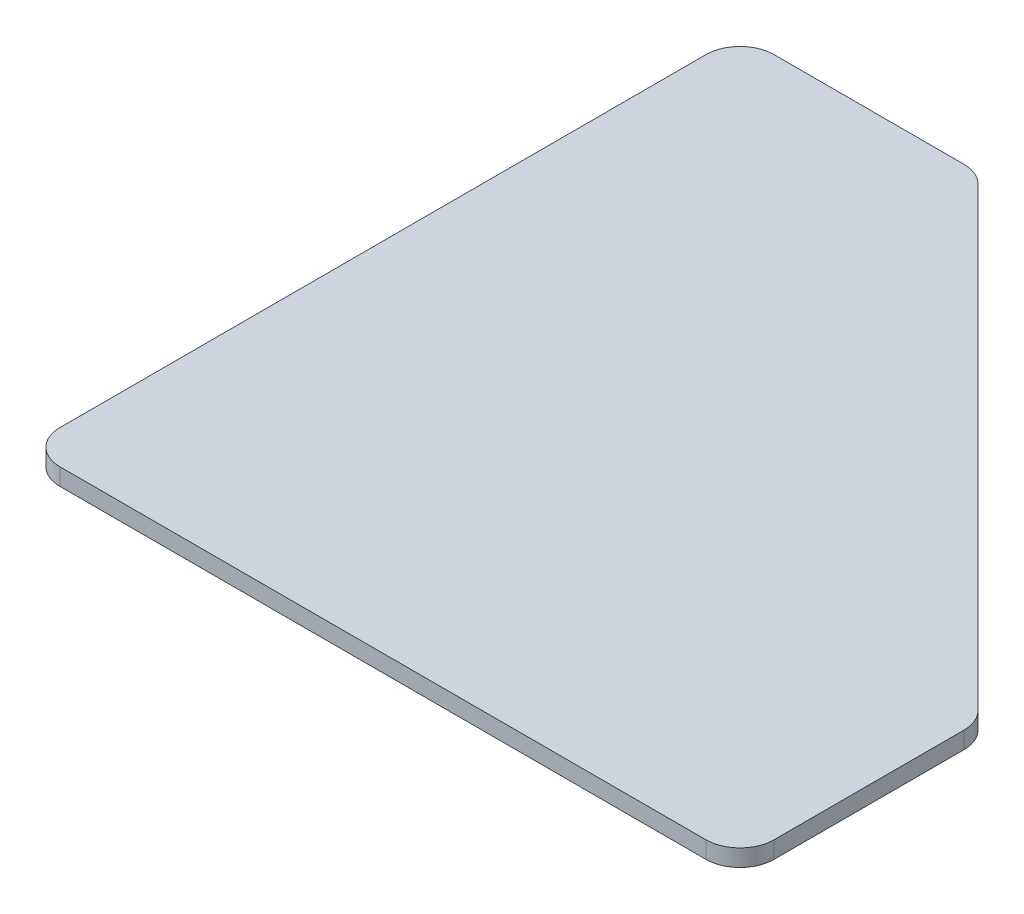
ISO-10303-21;
HEADER;
FILE_DESCRIPTION(('STEP AP214'),'2;1');
FILE_NAME('part.step','',(''),(''),'','','');
FILE_SCHEMA(('AUTOMOTIVE_DESIGN { 1 0 10303 214 1 1 1 1 }'));
ENDSEC;
DATA;
#1=APPLICATION_CONTEXT('core data for automotive mechanical design processes');
#2=APPLICATION_PROTOCOL_DEFINITION('international standard','automotive_design',2000,#1);
#3=PRODUCT_CONTEXT('',#1,'mechanical');
#4=PRODUCT('Part','Part','',(#3));
#5=PRODUCT_RELATED_PRODUCT_CATEGORY('part','',(#4));
#6=PRODUCT_DEFINITION_FORMATION('','',#4);
#7=PRODUCT_DEFINITION_CONTEXT('part definition',#1,'design');
#8=PRODUCT_DEFINITION('design','',#6,#7);
#9=PRODUCT_DEFINITION_SHAPE('','',#8);
#10=(LENGTH_UNIT() NAMED_UNIT(*) SI_UNIT(.MILLI.,.METRE.));
#11=(NAMED_UNIT(*) PLANE_ANGLE_UNIT() SI_UNIT($,.RADIAN.));
#12=(NAMED_UNIT(*) SI_UNIT($,.STERADIAN.) SOLID_ANGLE_UNIT());
#13=UNCERTAINTY_MEASURE_WITH_UNIT(LENGTH_MEASURE(1.E-05),#10,'distance_accuracy_value','');
#14=(GEOMETRIC_REPRESENTATION_CONTEXT(3) GLOBAL_UNCERTAINTY_ASSIGNED_CONTEXT((#13)) GLOBAL_UNIT_ASSIGNED_CONTEXT((#10,
#11,#12)) REPRESENTATION_CONTEXT('',''));
#15=CARTESIAN_POINT('',(0.,0.,0.));
#16=DIRECTION('',(0.,0.,1.));
#17=DIRECTION('',(1.,0.,0.));
#18=AXIS2_PLACEMENT_3D('',#15,#16,#17);
#19=CARTESIAN_POINT('',(133.35,3.175,0.));
#20=DIRECTION('',(0.,0.,-1.));
#21=DIRECTION('',(-1.,0.,0.));
#22=AXIS2_PLACEMENT_3D('',#19,#20,#21);
#23=PLANE('',#22);
#24=DIRECTION('',(1.,0.,0.));
#25=VECTOR('',#24,1.);
#26=CARTESIAN_POINT('',(133.35,0.,0.));
#27=LINE('',#26,#25);
#28=CARTESIAN_POINT('',(6.34999999999999,0.,0.));
#29=VERTEX_POINT('',#28);
#30=CARTESIAN_POINT('',(127.,0.,0.));
#31=VERTEX_POINT('',#30);
#32=EDGE_CURVE('E180',#29,#31,#27,.T.);
#33=ORIENTED_EDGE('',*,*,#32,.T.);
#34=DIRECTION('',(0.,-1.,0.));
#35=VECTOR('',#34,1.);
#36=CARTESIAN_POINT('',(127.,3.175,0.));
#37=LINE('',#36,#35);
#38=CARTESIAN_POINT('',(127.,3.175,0.));
#39=VERTEX_POINT('',#38);
#40=EDGE_CURVE('E11',#31,#39,#37,.F.);
#41=ORIENTED_EDGE('',*,*,#40,.T.);
#42=DIRECTION('',(1.,0.,0.));
#43=VECTOR('',#42,1.);
#44=CARTESIAN_POINT('',(133.35,3.175,0.));
#45=LINE('',#44,#43);
#46=CARTESIAN_POINT('',(6.34999999999999,3.175,0.));
#47=VERTEX_POINT('',#46);
#48=EDGE_CURVE('E138',#47,#39,#45,.T.);
#49=ORIENTED_EDGE('',*,*,#48,.F.);
#50=DIRECTION('',(0.,-1.,0.));
#51=VECTOR('',#50,1.);
#52=CARTESIAN_POINT('',(6.34999999999999,3.175,0.));
#53=LINE('',#52,#51);
#54=EDGE_CURVE('E42',#47,#29,#53,.T.);
#55=ORIENTED_EDGE('',*,*,#54,.T.);
#56=EDGE_LOOP('',(#33,#41,#49,#55));
#57=FACE_BOUND('',#56,.T.);
#58=ADVANCED_FACE('F34',(#57),#23,.F.);
#59=CARTESIAN_POINT('',(133.35,3.175,-44.45));
#60=DIRECTION('',(-1.,0.,0.));
#61=DIRECTION('',(0.,0.,1.));
#62=AXIS2_PLACEMENT_3D('',#59,#60,#61);
#63=PLANE('',#62);
#64=DIRECTION('',(0.,0.,-1.));
#65=VECTOR('',#64,1.);
#66=CARTESIAN_POINT('',(133.35,0.,-44.45));
#67=LINE('',#66,#65);
#68=CARTESIAN_POINT('',(133.35,0.,-6.35));
#69=VERTEX_POINT('',#68);
#70=CARTESIAN_POINT('',(133.35,0.,-41.8197438789308));
#71=VERTEX_POINT('',#70);
#72=EDGE_CURVE('E185',#69,#71,#67,.T.);
#73=ORIENTED_EDGE('',*,*,#72,.T.);
#74=DIRECTION('',(0.,-1.,0.));
#75=VECTOR('',#74,1.);
#76=CARTESIAN_POINT('',(133.35,3.175,-41.8197438789308));
#77=LINE('',#76,#75);
#78=CARTESIAN_POINT('',(133.35,3.175,-41.8197438789308));
#79=VERTEX_POINT('',#78);
#80=EDGE_CURVE('E174',#71,#79,#77,.F.);
#81=ORIENTED_EDGE('',*,*,#80,.T.);
#82=DIRECTION('',(0.,0.,-1.));
#83=VECTOR('',#82,1.);
#84=CARTESIAN_POINT('',(133.35,3.175,-44.45));
#85=LINE('',#84,#83);
#86=CARTESIAN_POINT('',(133.35,3.175,-6.35));
#87=VERTEX_POINT('',#86);
#88=EDGE_CURVE('E142',#87,#79,#85,.T.);
#89=ORIENTED_EDGE('',*,*,#88,.F.);
#90=DIRECTION('',(0.,-1.,0.));
#91=VECTOR('',#90,1.);
#92=CARTESIAN_POINT('',(133.35,3.175,-6.35));
#93=LINE('',#92,#91);
#94=EDGE_CURVE('E171',#87,#69,#93,.T.);
#95=ORIENTED_EDGE('',*,*,#94,.T.);
#96=EDGE_LOOP('',(#73,#81,#89,#95));
#97=FACE_BOUND('',#96,.T.);
#98=ADVANCED_FACE('F214',(#97),#63,.F.);
#99=CARTESIAN_POINT('',(44.45,3.175,-133.35));
#100=DIRECTION('',(-0.707106781186548,0.,0.707106781186548));
#101=DIRECTION('',(0.707106781186548,0.,0.707106781186548));
#102=AXIS2_PLACEMENT_3D('',#99,#100,#101);
#103=PLANE('',#102);
#104=DIRECTION('',(-0.707106781186548,0.,-0.707106781186548));
#105=VECTOR('',#104,1.);
#106=CARTESIAN_POINT('',(44.45,0.,-133.35));
#107=LINE('',#106,#105);
#108=CARTESIAN_POINT('',(131.490128060535,0.,-46.3098719394654));
#109=VERTEX_POINT('',#108);
#110=CARTESIAN_POINT('',(46.3098719394654,0.,-131.490128060535));
#111=VERTEX_POINT('',#110);
#112=EDGE_CURVE('E144',#109,#111,#107,.T.);
#113=ORIENTED_EDGE('',*,*,#112,.T.);
#114=DIRECTION('',(0.,-1.,0.));
#115=VECTOR('',#114,1.);
#116=CARTESIAN_POINT('',(46.3098719394654,3.175,-131.490128060535));
#117=LINE('',#116,#115);
#118=CARTESIAN_POINT('',(46.3098719394654,3.175,-131.490128060535));
#119=VERTEX_POINT('',#118);
#120=EDGE_CURVE('E49',#111,#119,#117,.F.);
#121=ORIENTED_EDGE('',*,*,#120,.T.);
#122=DIRECTION('',(-0.707106781186548,0.,-0.707106781186548));
#123=VECTOR('',#122,1.);
#124=CARTESIAN_POINT('',(44.45,3.175,-133.35));
#125=LINE('',#124,#123);
#126=CARTESIAN_POINT('',(131.490128060535,3.175,-46.3098719394654));
#127=VERTEX_POINT('',#126);
#128=EDGE_CURVE('E202',#127,#119,#125,.T.);
#129=ORIENTED_EDGE('',*,*,#128,.F.);
#130=DIRECTION('',(0.,-1.,0.));
#131=VECTOR('',#130,1.);
#132=CARTESIAN_POINT('',(131.490128060535,3.175,-46.3098719394654));
#133=LINE('',#132,#131);
#134=EDGE_CURVE('E167',#127,#109,#133,.T.);
#135=ORIENTED_EDGE('',*,*,#134,.T.);
#136=EDGE_LOOP('',(#113,#121,#129,#135));
#137=FACE_BOUND('',#136,.T.);
#138=ADVANCED_FACE('F192',(#137),#103,.F.);
#139=CARTESIAN_POINT('',(0.,3.175,-133.35));
#140=DIRECTION('',(0.,0.,1.));
#141=DIRECTION('',(1.,0.,0.));
#142=AXIS2_PLACEMENT_3D('',#139,#140,#141);
#143=PLANE('',#142);
#144=DIRECTION('',(-1.,0.,0.));
#145=VECTOR('',#144,1.);
#146=CARTESIAN_POINT('',(0.,0.,-133.35));
#147=LINE('',#146,#145);
#148=CARTESIAN_POINT('',(41.8197438789308,0.,-133.35));
#149=VERTEX_POINT('',#148);
#150=CARTESIAN_POINT('',(6.35,0.,-133.35));
#151=VERTEX_POINT('',#150);
#152=EDGE_CURVE('E139',#149,#151,#147,.T.);
#153=ORIENTED_EDGE('',*,*,#152,.T.);
#154=DIRECTION('',(0.,-1.,0.));
#155=VECTOR('',#154,1.);
#156=CARTESIAN_POINT('',(6.35,3.175,-133.35));
#157=LINE('',#156,#155);
#158=CARTESIAN_POINT('',(6.35,3.175,-133.35));
#159=VERTEX_POINT('',#158);
#160=EDGE_CURVE('E117',#151,#159,#157,.F.);
#161=ORIENTED_EDGE('',*,*,#160,.T.);
#162=DIRECTION('',(-1.,0.,0.));
#163=VECTOR('',#162,1.);
#164=CARTESIAN_POINT('',(0.,3.175,-133.35));
#165=LINE('',#164,#163);
#166=CARTESIAN_POINT('',(41.8197438789308,3.175,-133.35));
#167=VERTEX_POINT('',#166);
#168=EDGE_CURVE('E201',#167,#159,#165,.T.);
#169=ORIENTED_EDGE('',*,*,#168,.F.);
#170=DIRECTION('',(0.,-1.,0.));
#171=VECTOR('',#170,1.);
#172=CARTESIAN_POINT('',(41.8197438789308,3.175,-133.35));
#173=LINE('',#172,#171);
#174=EDGE_CURVE('E122',#167,#149,#173,.T.);
#175=ORIENTED_EDGE('',*,*,#174,.T.);
#176=EDGE_LOOP('',(#153,#161,#169,#175));
#177=FACE_BOUND('',#176,.T.);
#178=ADVANCED_FACE('F204',(#177),#143,.F.);
#179=CARTESIAN_POINT('',(0.,3.175,0.));
#180=DIRECTION('',(1.,0.,0.));
#181=DIRECTION('',(0.,0.,-1.));
#182=AXIS2_PLACEMENT_3D('',#179,#180,#181);
#183=PLANE('',#182);
#184=DIRECTION('',(0.,0.,1.));
#185=VECTOR('',#184,1.);
#186=CARTESIAN_POINT('',(0.,3.175,0.));
#187=LINE('',#186,#185);
#188=CARTESIAN_POINT('',(0.,3.175,-127.));
#189=VERTEX_POINT('',#188);
#190=CARTESIAN_POINT('',(0.,3.175,-6.35));
#191=VERTEX_POINT('',#190);
#192=EDGE_CURVE('E132',#189,#191,#187,.T.);
#193=ORIENTED_EDGE('',*,*,#192,.F.);
#194=DIRECTION('',(0.,-1.,0.));
#195=VECTOR('',#194,1.);
#196=CARTESIAN_POINT('',(0.,3.175,-127.));
#197=LINE('',#196,#195);
#198=CARTESIAN_POINT('',(0.,0.,-127.));
#199=VERTEX_POINT('',#198);
#200=EDGE_CURVE('E116',#189,#199,#197,.T.);
#201=ORIENTED_EDGE('',*,*,#200,.T.);
#202=DIRECTION('',(0.,0.,1.));
#203=VECTOR('',#202,1.);
#204=CARTESIAN_POINT('',(0.,0.,0.));
#205=LINE('',#204,#203);
#206=CARTESIAN_POINT('',(0.,0.,-6.35));
#207=VERTEX_POINT('',#206);
#208=EDGE_CURVE('E129',#199,#207,#205,.T.);
#209=ORIENTED_EDGE('',*,*,#208,.T.);
#210=DIRECTION('',(0.,-1.,0.));
#211=VECTOR('',#210,1.);
#212=CARTESIAN_POINT('',(0.,3.175,-6.35));
#213=LINE('',#212,#211);
#214=EDGE_CURVE('E134',#207,#191,#213,.F.);
#215=ORIENTED_EDGE('',*,*,#214,.T.);
#216=EDGE_LOOP('',(#193,#201,#209,#215));
#217=FACE_BOUND('',#216,.T.);
#218=ADVANCED_FACE('F128',(#217),#183,.F.);
#219=CARTESIAN_POINT('',(0.,3.175,0.));
#220=DIRECTION('',(0.,-1.,0.));
#221=DIRECTION('',(0.,0.,-1.));
#222=AXIS2_PLACEMENT_3D('',#219,#220,#221);
#223=PLANE('',#222);
#224=ORIENTED_EDGE('',*,*,#168,.T.);
#225=CARTESIAN_POINT('',(6.35,3.175,-127.));
#226=DIRECTION('',(0.,-1.,0.));
#227=DIRECTION('',(0.,0.,-1.));
#228=AXIS2_PLACEMENT_3D('',#225,#226,#227);
#229=CIRCLE('',#228,6.35);
#230=EDGE_CURVE('E165',#159,#189,#229,.F.);
#231=ORIENTED_EDGE('',*,*,#230,.T.);
#232=ORIENTED_EDGE('',*,*,#192,.T.);
#233=CARTESIAN_POINT('',(6.34999999999999,3.175,-6.35));
#234=DIRECTION('',(0.,-1.,0.));
#235=DIRECTION('',(0.,0.,-1.));
#236=AXIS2_PLACEMENT_3D('',#233,#234,#235);
#237=CIRCLE('',#236,6.35);
#238=EDGE_CURVE('E158',#191,#47,#237,.F.);
#239=ORIENTED_EDGE('',*,*,#238,.T.);
#240=ORIENTED_EDGE('',*,*,#48,.T.);
#241=CARTESIAN_POINT('',(127.,3.175,-6.35));
#242=DIRECTION('',(0.,-1.,0.));
#243=DIRECTION('',(0.,0.,-1.));
#244=AXIS2_PLACEMENT_3D('',#241,#242,#243);
#245=CIRCLE('',#244,6.35);
#246=EDGE_CURVE('E160',#39,#87,#245,.F.);
#247=ORIENTED_EDGE('',*,*,#246,.T.);
#248=ORIENTED_EDGE('',*,*,#88,.T.);
#249=CARTESIAN_POINT('',(127.,3.175,-41.8197438789308));
#250=DIRECTION('',(0.,-1.,0.));
#251=DIRECTION('',(0.,0.,-1.));
#252=AXIS2_PLACEMENT_3D('',#249,#250,#251);
#253=CIRCLE('',#252,6.35);
#254=EDGE_CURVE('E56',#79,#127,#253,.F.);
#255=ORIENTED_EDGE('',*,*,#254,.T.);
#256=ORIENTED_EDGE('',*,*,#128,.T.);
#257=CARTESIAN_POINT('',(41.8197438789308,3.175,-127.));
#258=DIRECTION('',(0.,-1.,0.));
#259=DIRECTION('',(0.,0.,-1.));
#260=AXIS2_PLACEMENT_3D('',#257,#258,#259);
#261=CIRCLE('',#260,6.35);
#262=EDGE_CURVE('E163',#119,#167,#261,.F.);
#263=ORIENTED_EDGE('',*,*,#262,.T.);
#264=EDGE_LOOP('',(#224,#231,#232,#239,#240,#247,#248,#255,#256,#263));
#265=FACE_BOUND('',#264,.T.);
#266=ADVANCED_FACE('F200',(#265),#223,.F.);
#267=CARTESIAN_POINT('',(0.,0.,0.));
#268=DIRECTION('',(0.,-1.,0.));
#269=DIRECTION('',(0.,0.,-1.));
#270=AXIS2_PLACEMENT_3D('',#267,#268,#269);
#271=PLANE('',#270);
#272=ORIENTED_EDGE('',*,*,#208,.F.);
#273=CARTESIAN_POINT('',(6.35,0.,-127.));
#274=DIRECTION('',(0.,-1.,0.));
#275=DIRECTION('',(0.,0.,-1.));
#276=AXIS2_PLACEMENT_3D('',#273,#274,#275);
#277=CIRCLE('',#276,6.35);
#278=EDGE_CURVE('E112',#199,#151,#277,.T.);
#279=ORIENTED_EDGE('',*,*,#278,.T.);
#280=ORIENTED_EDGE('',*,*,#152,.F.);
#281=CARTESIAN_POINT('',(41.8197438789308,0.,-127.));
#282=DIRECTION('',(0.,-1.,0.));
#283=DIRECTION('',(0.,0.,-1.));
#284=AXIS2_PLACEMENT_3D('',#281,#282,#283);
#285=CIRCLE('',#284,6.35);
#286=EDGE_CURVE('E123',#149,#111,#285,.T.);
#287=ORIENTED_EDGE('',*,*,#286,.T.);
#288=ORIENTED_EDGE('',*,*,#112,.F.);
#289=CARTESIAN_POINT('',(127.,0.,-41.8197438789308));
#290=DIRECTION('',(0.,-1.,0.));
#291=DIRECTION('',(0.,0.,-1.));
#292=AXIS2_PLACEMENT_3D('',#289,#290,#291);
#293=CIRCLE('',#292,6.35);
#294=EDGE_CURVE('E152',#109,#71,#293,.T.);
#295=ORIENTED_EDGE('',*,*,#294,.T.);
#296=ORIENTED_EDGE('',*,*,#72,.F.);
#297=CARTESIAN_POINT('',(127.,0.,-6.35));
#298=DIRECTION('',(0.,-1.,0.));
#299=DIRECTION('',(0.,0.,-1.));
#300=AXIS2_PLACEMENT_3D('',#297,#298,#299);
#301=CIRCLE('',#300,6.35);
#302=EDGE_CURVE('E150',#69,#31,#301,.T.);
#303=ORIENTED_EDGE('',*,*,#302,.T.);
#304=ORIENTED_EDGE('',*,*,#32,.F.);
#305=CARTESIAN_POINT('',(6.34999999999999,0.,-6.35));
#306=DIRECTION('',(0.,-1.,0.));
#307=DIRECTION('',(0.,0.,-1.));
#308=AXIS2_PLACEMENT_3D('',#305,#306,#307);
#309=CIRCLE('',#308,6.35);
#310=EDGE_CURVE('E133',#29,#207,#309,.T.);
#311=ORIENTED_EDGE('',*,*,#310,.T.);
#312=EDGE_LOOP('',(#272,#279,#280,#287,#288,#295,#296,#303,#304,#311));
#313=FACE_BOUND('',#312,.T.);
#314=ADVANCED_FACE('F136',(#313),#271,.T.);
#315=CARTESIAN_POINT('',(6.35,3.175,-127.));
#316=DIRECTION('',(0.,-1.,0.));
#317=DIRECTION('',(0.,0.,-1.));
#318=AXIS2_PLACEMENT_3D('',#315,#316,#317);
#319=CYLINDRICAL_SURFACE('',#318,6.35);
#320=ORIENTED_EDGE('',*,*,#230,.F.);
#321=ORIENTED_EDGE('',*,*,#160,.F.);
#322=ORIENTED_EDGE('',*,*,#278,.F.);
#323=ORIENTED_EDGE('',*,*,#200,.F.);
#324=EDGE_LOOP('',(#320,#321,#322,#323));
#325=FACE_BOUND('',#324,.T.);
#326=ADVANCED_FACE('F115',(#325),#319,.T.);
#327=CARTESIAN_POINT('',(41.8197438789308,3.175,-127.));
#328=DIRECTION('',(0.,-1.,0.));
#329=DIRECTION('',(0.,0.,-1.));
#330=AXIS2_PLACEMENT_3D('',#327,#328,#329);
#331=CYLINDRICAL_SURFACE('',#330,6.35);
#332=ORIENTED_EDGE('',*,*,#262,.F.);
#333=ORIENTED_EDGE('',*,*,#120,.F.);
#334=ORIENTED_EDGE('',*,*,#286,.F.);
#335=ORIENTED_EDGE('',*,*,#174,.F.);
#336=EDGE_LOOP('',(#332,#333,#334,#335));
#337=FACE_BOUND('',#336,.T.);
#338=ADVANCED_FACE('F196',(#337),#331,.T.);
#339=CARTESIAN_POINT('',(127.,3.175,-41.8197438789308));
#340=DIRECTION('',(0.,-1.,0.));
#341=DIRECTION('',(0.,0.,-1.));
#342=AXIS2_PLACEMENT_3D('',#339,#340,#341);
#343=CYLINDRICAL_SURFACE('',#342,6.35);
#344=ORIENTED_EDGE('',*,*,#254,.F.);
#345=ORIENTED_EDGE('',*,*,#80,.F.);
#346=ORIENTED_EDGE('',*,*,#294,.F.);
#347=ORIENTED_EDGE('',*,*,#134,.F.);
#348=EDGE_LOOP('',(#344,#345,#346,#347));
#349=FACE_BOUND('',#348,.T.);
#350=ADVANCED_FACE('F213',(#349),#343,.T.);
#351=CARTESIAN_POINT('',(127.,3.175,-6.35));
#352=DIRECTION('',(0.,-1.,0.));
#353=DIRECTION('',(0.,0.,-1.));
#354=AXIS2_PLACEMENT_3D('',#351,#352,#353);
#355=CYLINDRICAL_SURFACE('',#354,6.35);
#356=ORIENTED_EDGE('',*,*,#246,.F.);
#357=ORIENTED_EDGE('',*,*,#40,.F.);
#358=ORIENTED_EDGE('',*,*,#302,.F.);
#359=ORIENTED_EDGE('',*,*,#94,.F.);
#360=EDGE_LOOP('',(#356,#357,#358,#359));
#361=FACE_BOUND('',#360,.T.);
#362=ADVANCED_FACE('F216',(#361),#355,.T.);
#363=CARTESIAN_POINT('',(6.34999999999999,3.175,-6.35));
#364=DIRECTION('',(0.,-1.,0.));
#365=DIRECTION('',(0.,0.,-1.));
#366=AXIS2_PLACEMENT_3D('',#363,#364,#365);
#367=CYLINDRICAL_SURFACE('',#366,6.35);
#368=ORIENTED_EDGE('',*,*,#238,.F.);
#369=ORIENTED_EDGE('',*,*,#214,.F.);
#370=ORIENTED_EDGE('',*,*,#310,.F.);
#371=ORIENTED_EDGE('',*,*,#54,.F.);
#372=EDGE_LOOP('',(#368,#369,#370,#371));
#373=FACE_BOUND('',#372,.T.);
#374=ADVANCED_FACE('F36',(#373),#367,.T.);
#375=CLOSED_SHELL('',(#58,#98,#138,#178,#218,#266,#314,#326,#338,#350,#362,#374));
#376=MANIFOLD_SOLID_BREP('B2',#375);
#377=ADVANCED_BREP_SHAPE_REPRESENTATION('',(#18,#376),#14);
#378=SHAPE_DEFINITION_REPRESENTATION(#9,#377);
ENDSEC;
END-ISO-10303-21;
